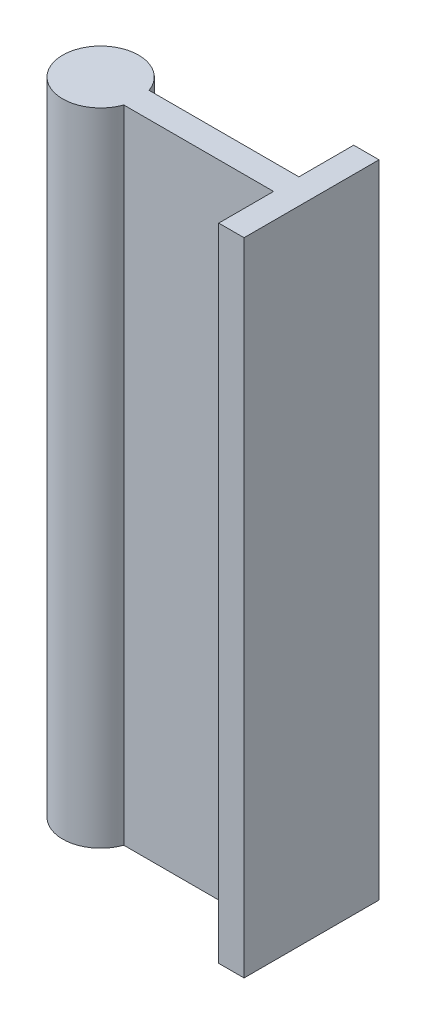
ISO-10303-21;
HEADER;
FILE_DESCRIPTION(('STEP AP214'),'2;1');
FILE_NAME('part.step','',(''),(''),'','','');
FILE_SCHEMA(('AUTOMOTIVE_DESIGN { 1 0 10303 214 1 1 1 1 }'));
ENDSEC;
DATA;
#1=APPLICATION_CONTEXT('core data for automotive mechanical design processes');
#2=APPLICATION_PROTOCOL_DEFINITION('international standard','automotive_design',2000,#1);
#3=PRODUCT_CONTEXT('',#1,'mechanical');
#4=PRODUCT('Part','Part','',(#3));
#5=PRODUCT_RELATED_PRODUCT_CATEGORY('part','',(#4));
#6=PRODUCT_DEFINITION_FORMATION('','',#4);
#7=PRODUCT_DEFINITION_CONTEXT('part definition',#1,'design');
#8=PRODUCT_DEFINITION('design','',#6,#7);
#9=PRODUCT_DEFINITION_SHAPE('','',#8);
#10=(LENGTH_UNIT() NAMED_UNIT(*) SI_UNIT(.MILLI.,.METRE.));
#11=(NAMED_UNIT(*) PLANE_ANGLE_UNIT() SI_UNIT($,.RADIAN.));
#12=(NAMED_UNIT(*) SI_UNIT($,.STERADIAN.) SOLID_ANGLE_UNIT());
#13=UNCERTAINTY_MEASURE_WITH_UNIT(LENGTH_MEASURE(1.E-05),#10,'distance_accuracy_value','');
#14=(GEOMETRIC_REPRESENTATION_CONTEXT(3) GLOBAL_UNCERTAINTY_ASSIGNED_CONTEXT((#13)) GLOBAL_UNIT_ASSIGNED_CONTEXT((#10,
#11,#12)) REPRESENTATION_CONTEXT('',''));
#15=CARTESIAN_POINT('',(0.,0.,0.));
#16=DIRECTION('',(0.,0.,1.));
#17=DIRECTION('',(1.,0.,0.));
#18=AXIS2_PLACEMENT_3D('',#15,#16,#17);
#19=CARTESIAN_POINT('',(0.,38.,0.));
#20=DIRECTION('',(0.,-1.,0.));
#21=DIRECTION('',(0.,0.,-1.));
#22=AXIS2_PLACEMENT_3D('',#19,#20,#21);
#23=CYLINDRICAL_SURFACE('',#22,2.25);
#24=CARTESIAN_POINT('',(0.,38.,0.));
#25=DIRECTION('',(0.,1.,0.));
#26=DIRECTION('',(0.,0.,1.));
#27=AXIS2_PLACEMENT_3D('',#24,#25,#26);
#28=CIRCLE('',#27,2.25);
#29=CARTESIAN_POINT('',(2.12132034355964,38.,-0.749999999999998));
#30=VERTEX_POINT('',#29);
#31=CARTESIAN_POINT('',(2.12132034355964,38.,0.750000000000002));
#32=VERTEX_POINT('',#31);
#33=EDGE_CURVE('E11',#30,#32,#28,.T.);
#34=ORIENTED_EDGE('',*,*,#33,.F.);
#35=DIRECTION('',(0.,-1.,0.));
#36=VECTOR('',#35,1.);
#37=CARTESIAN_POINT('',(2.12132034355964,38.,-0.749999999999998));
#38=LINE('',#37,#36);
#39=CARTESIAN_POINT('',(2.12132034355964,0.,-0.750000000000003));
#40=VERTEX_POINT('',#39);
#41=EDGE_CURVE('E141',#30,#40,#38,.T.);
#42=ORIENTED_EDGE('',*,*,#41,.T.);
#43=CARTESIAN_POINT('',(0.,0.,0.));
#44=DIRECTION('',(0.,1.,0.));
#45=DIRECTION('',(0.,0.,1.));
#46=AXIS2_PLACEMENT_3D('',#43,#44,#45);
#47=CIRCLE('',#46,2.25);
#48=CARTESIAN_POINT('',(2.12132034355964,0.,0.749999999999997));
#49=VERTEX_POINT('',#48);
#50=EDGE_CURVE('E36',#40,#49,#47,.T.);
#51=ORIENTED_EDGE('',*,*,#50,.T.);
#52=DIRECTION('',(0.,-1.,0.));
#53=VECTOR('',#52,1.);
#54=CARTESIAN_POINT('',(2.12132034355964,38.,0.750000000000002));
#55=LINE('',#54,#53);
#56=EDGE_CURVE('E133',#49,#32,#55,.F.);
#57=ORIENTED_EDGE('',*,*,#56,.T.);
#58=EDGE_LOOP('',(#34,#42,#51,#57));
#59=FACE_BOUND('',#58,.T.);
#60=ADVANCED_FACE('F33',(#59),#23,.T.);
#61=CARTESIAN_POINT('',(0.,38.,0.));
#62=DIRECTION('',(0.,1.,0.));
#63=DIRECTION('',(0.,0.,1.));
#64=AXIS2_PLACEMENT_3D('',#61,#62,#63);
#65=PLANE('',#64);
#66=ORIENTED_EDGE('',*,*,#33,.T.);
#67=DIRECTION('',(1.,0.,0.));
#68=VECTOR('',#67,1.);
#69=CARTESIAN_POINT('',(0.,38.,0.750000000000002));
#70=LINE('',#69,#68);
#71=CARTESIAN_POINT('',(11.,38.,0.750000000000002));
#72=VERTEX_POINT('',#71);
#73=EDGE_CURVE('E136',#32,#72,#70,.T.);
#74=ORIENTED_EDGE('',*,*,#73,.T.);
#75=DIRECTION('',(0.,0.,1.));
#76=VECTOR('',#75,1.);
#77=CARTESIAN_POINT('',(11.,38.,4.));
#78=LINE('',#77,#76);
#79=CARTESIAN_POINT('',(11.,38.,4.));
#80=VERTEX_POINT('',#79);
#81=EDGE_CURVE('E159',#72,#80,#78,.T.);
#82=ORIENTED_EDGE('',*,*,#81,.T.);
#83=DIRECTION('',(-1.,0.,0.));
#84=VECTOR('',#83,1.);
#85=CARTESIAN_POINT('',(12.5,38.,4.));
#86=LINE('',#85,#84);
#87=CARTESIAN_POINT('',(12.5,38.,4.));
#88=VERTEX_POINT('',#87);
#89=EDGE_CURVE('E103',#88,#80,#86,.T.);
#90=ORIENTED_EDGE('',*,*,#89,.F.);
#91=DIRECTION('',(0.,0.,1.));
#92=VECTOR('',#91,1.);
#93=CARTESIAN_POINT('',(12.5,38.,4.));
#94=LINE('',#93,#92);
#95=CARTESIAN_POINT('',(12.5,38.,-4.));
#96=VERTEX_POINT('',#95);
#97=EDGE_CURVE('E96',#96,#88,#94,.T.);
#98=ORIENTED_EDGE('',*,*,#97,.F.);
#99=DIRECTION('',(-1.,0.,0.));
#100=VECTOR('',#99,1.);
#101=CARTESIAN_POINT('',(12.5,38.,-4.));
#102=LINE('',#101,#100);
#103=CARTESIAN_POINT('',(11.,38.,-4.));
#104=VERTEX_POINT('',#103);
#105=EDGE_CURVE('E100',#96,#104,#102,.T.);
#106=ORIENTED_EDGE('',*,*,#105,.T.);
#107=CARTESIAN_POINT('',(11.,38.,-0.749999999999998));
#108=VERTEX_POINT('',#107);
#109=EDGE_CURVE('E161',#104,#108,#78,.T.);
#110=ORIENTED_EDGE('',*,*,#109,.T.);
#111=DIRECTION('',(1.,0.,0.));
#112=VECTOR('',#111,1.);
#113=CARTESIAN_POINT('',(0.,38.,-0.749999999999998));
#114=LINE('',#113,#112);
#115=EDGE_CURVE('E46',#30,#108,#114,.T.);
#116=ORIENTED_EDGE('',*,*,#115,.F.);
#117=EDGE_LOOP('',(#66,#74,#82,#90,#98,#106,#110,#116));
#118=FACE_BOUND('',#117,.T.);
#119=ADVANCED_FACE('F98',(#118),#65,.T.);
#120=CARTESIAN_POINT('',(0.,0.,0.));
#121=DIRECTION('',(0.,1.,0.));
#122=DIRECTION('',(0.,0.,1.));
#123=AXIS2_PLACEMENT_3D('',#120,#121,#122);
#124=PLANE('',#123);
#125=ORIENTED_EDGE('',*,*,#50,.F.);
#126=DIRECTION('',(1.,0.,0.));
#127=VECTOR('',#126,1.);
#128=CARTESIAN_POINT('',(0.,0.,-0.750000000000003));
#129=LINE('',#128,#127);
#130=CARTESIAN_POINT('',(11.,0.,-0.750000000000003));
#131=VERTEX_POINT('',#130);
#132=EDGE_CURVE('E53',#40,#131,#129,.T.);
#133=ORIENTED_EDGE('',*,*,#132,.T.);
#134=DIRECTION('',(0.,0.,-1.));
#135=VECTOR('',#134,1.);
#136=CARTESIAN_POINT('',(11.,0.,4.));
#137=LINE('',#136,#135);
#138=CARTESIAN_POINT('',(11.,0.,-4.));
#139=VERTEX_POINT('',#138);
#140=EDGE_CURVE('E167',#131,#139,#137,.T.);
#141=ORIENTED_EDGE('',*,*,#140,.T.);
#142=DIRECTION('',(-1.,0.,0.));
#143=VECTOR('',#142,1.);
#144=CARTESIAN_POINT('',(12.5,0.,-4.));
#145=LINE('',#144,#143);
#146=CARTESIAN_POINT('',(12.5,0.,-4.));
#147=VERTEX_POINT('',#146);
#148=EDGE_CURVE('E169',#147,#139,#145,.T.);
#149=ORIENTED_EDGE('',*,*,#148,.F.);
#150=DIRECTION('',(0.,0.,-1.));
#151=VECTOR('',#150,1.);
#152=CARTESIAN_POINT('',(12.5,0.,4.));
#153=LINE('',#152,#151);
#154=CARTESIAN_POINT('',(12.5,0.,4.));
#155=VERTEX_POINT('',#154);
#156=EDGE_CURVE('E112',#155,#147,#153,.T.);
#157=ORIENTED_EDGE('',*,*,#156,.F.);
#158=DIRECTION('',(-1.,0.,0.));
#159=VECTOR('',#158,1.);
#160=CARTESIAN_POINT('',(12.5,0.,4.));
#161=LINE('',#160,#159);
#162=CARTESIAN_POINT('',(11.,0.,4.));
#163=VERTEX_POINT('',#162);
#164=EDGE_CURVE('E126',#155,#163,#161,.T.);
#165=ORIENTED_EDGE('',*,*,#164,.T.);
#166=CARTESIAN_POINT('',(11.,0.,0.75));
#167=VERTEX_POINT('',#166);
#168=EDGE_CURVE('E116',#163,#167,#137,.T.);
#169=ORIENTED_EDGE('',*,*,#168,.T.);
#170=DIRECTION('',(1.,0.,0.));
#171=VECTOR('',#170,1.);
#172=CARTESIAN_POINT('',(0.,0.,0.749999999999997));
#173=LINE('',#172,#171);
#174=EDGE_CURVE('E134',#49,#167,#173,.T.);
#175=ORIENTED_EDGE('',*,*,#174,.F.);
#176=EDGE_LOOP('',(#125,#133,#141,#149,#157,#165,#169,#175));
#177=FACE_BOUND('',#176,.T.);
#178=ADVANCED_FACE('F148',(#177),#124,.F.);
#179=CARTESIAN_POINT('',(0.,38.,-0.749999999999998));
#180=DIRECTION('',(0.,0.,-1.));
#181=DIRECTION('',(0.,1.,0.));
#182=AXIS2_PLACEMENT_3D('',#179,#180,#181);
#183=PLANE('',#182);
#184=ORIENTED_EDGE('',*,*,#41,.F.);
#185=ORIENTED_EDGE('',*,*,#115,.T.);
#186=DIRECTION('',(0.,1.,0.));
#187=VECTOR('',#186,1.);
#188=CARTESIAN_POINT('',(11.,38.,-0.749999999999998));
#189=LINE('',#188,#187);
#190=EDGE_CURVE('E121',#131,#108,#189,.T.);
#191=ORIENTED_EDGE('',*,*,#190,.F.);
#192=ORIENTED_EDGE('',*,*,#132,.F.);
#193=EDGE_LOOP('',(#184,#185,#191,#192));
#194=FACE_BOUND('',#193,.T.);
#195=ADVANCED_FACE('F191',(#194),#183,.T.);
#196=CARTESIAN_POINT('',(0.,38.,0.750000000000002));
#197=DIRECTION('',(0.,0.,1.));
#198=DIRECTION('',(0.,-1.,0.));
#199=AXIS2_PLACEMENT_3D('',#196,#197,#198);
#200=PLANE('',#199);
#201=ORIENTED_EDGE('',*,*,#56,.F.);
#202=ORIENTED_EDGE('',*,*,#174,.T.);
#203=DIRECTION('',(0.,-1.,0.));
#204=VECTOR('',#203,1.);
#205=CARTESIAN_POINT('',(11.,38.,0.750000000000002));
#206=LINE('',#205,#204);
#207=EDGE_CURVE('E124',#72,#167,#206,.T.);
#208=ORIENTED_EDGE('',*,*,#207,.F.);
#209=ORIENTED_EDGE('',*,*,#73,.F.);
#210=EDGE_LOOP('',(#201,#202,#208,#209));
#211=FACE_BOUND('',#210,.T.);
#212=ADVANCED_FACE('F154',(#211),#200,.T.);
#213=CARTESIAN_POINT('',(11.,0.,0.));
#214=DIRECTION('',(1.,0.,0.));
#215=DIRECTION('',(0.,0.,-1.));
#216=AXIS2_PLACEMENT_3D('',#213,#214,#215);
#217=PLANE('',#216);
#218=ORIENTED_EDGE('',*,*,#140,.F.);
#219=ORIENTED_EDGE('',*,*,#190,.T.);
#220=ORIENTED_EDGE('',*,*,#109,.F.);
#221=DIRECTION('',(0.,1.,0.));
#222=VECTOR('',#221,1.);
#223=CARTESIAN_POINT('',(11.,38.,-4.));
#224=LINE('',#223,#222);
#225=EDGE_CURVE('E120',#139,#104,#224,.T.);
#226=ORIENTED_EDGE('',*,*,#225,.F.);
#227=EDGE_LOOP('',(#218,#219,#220,#226));
#228=FACE_BOUND('',#227,.T.);
#229=ADVANCED_FACE('F196',(#228),#217,.F.);
#230=ORIENTED_EDGE('',*,*,#81,.F.);
#231=ORIENTED_EDGE('',*,*,#207,.T.);
#232=ORIENTED_EDGE('',*,*,#168,.F.);
#233=DIRECTION('',(0.,-1.,0.));
#234=VECTOR('',#233,1.);
#235=CARTESIAN_POINT('',(11.,38.,4.));
#236=LINE('',#235,#234);
#237=EDGE_CURVE('E160',#80,#163,#236,.T.);
#238=ORIENTED_EDGE('',*,*,#237,.F.);
#239=EDGE_LOOP('',(#230,#231,#232,#238));
#240=FACE_BOUND('',#239,.T.);
#241=ADVANCED_FACE('F157',(#240),#217,.F.);
#242=CARTESIAN_POINT('',(12.5,38.,-4.));
#243=DIRECTION('',(0.,0.,1.));
#244=DIRECTION('',(0.,-1.,0.));
#245=AXIS2_PLACEMENT_3D('',#242,#243,#244);
#246=PLANE('',#245);
#247=ORIENTED_EDGE('',*,*,#225,.T.);
#248=ORIENTED_EDGE('',*,*,#105,.F.);
#249=DIRECTION('',(0.,1.,0.));
#250=VECTOR('',#249,1.);
#251=CARTESIAN_POINT('',(12.5,38.,-4.));
#252=LINE('',#251,#250);
#253=EDGE_CURVE('E107',#147,#96,#252,.T.);
#254=ORIENTED_EDGE('',*,*,#253,.F.);
#255=ORIENTED_EDGE('',*,*,#148,.T.);
#256=EDGE_LOOP('',(#247,#248,#254,#255));
#257=FACE_BOUND('',#256,.T.);
#258=ADVANCED_FACE('F118',(#257),#246,.F.);
#259=CARTESIAN_POINT('',(12.5,38.,4.));
#260=DIRECTION('',(0.,0.,-1.));
#261=DIRECTION('',(0.,1.,0.));
#262=AXIS2_PLACEMENT_3D('',#259,#260,#261);
#263=PLANE('',#262);
#264=ORIENTED_EDGE('',*,*,#237,.T.);
#265=ORIENTED_EDGE('',*,*,#164,.F.);
#266=DIRECTION('',(0.,-1.,0.));
#267=VECTOR('',#266,1.);
#268=CARTESIAN_POINT('',(12.5,38.,4.));
#269=LINE('',#268,#267);
#270=EDGE_CURVE('E106',#88,#155,#269,.T.);
#271=ORIENTED_EDGE('',*,*,#270,.F.);
#272=ORIENTED_EDGE('',*,*,#89,.T.);
#273=EDGE_LOOP('',(#264,#265,#271,#272));
#274=FACE_BOUND('',#273,.T.);
#275=ADVANCED_FACE('F172',(#274),#263,.F.);
#276=CARTESIAN_POINT('',(12.5,0.,0.));
#277=DIRECTION('',(1.,0.,0.));
#278=DIRECTION('',(0.,0.,-1.));
#279=AXIS2_PLACEMENT_3D('',#276,#277,#278);
#280=PLANE('',#279);
#281=ORIENTED_EDGE('',*,*,#253,.T.);
#282=ORIENTED_EDGE('',*,*,#97,.T.);
#283=ORIENTED_EDGE('',*,*,#270,.T.);
#284=ORIENTED_EDGE('',*,*,#156,.T.);
#285=EDGE_LOOP('',(#281,#282,#283,#284));
#286=FACE_BOUND('',#285,.T.);
#287=ADVANCED_FACE('F110',(#286),#280,.T.);
#288=CLOSED_SHELL('',(#60,#119,#178,#195,#212,#229,#241,#258,#275,#287));
#289=MANIFOLD_SOLID_BREP('B2',#288);
#290=ADVANCED_BREP_SHAPE_REPRESENTATION('',(#18,#289),#14);
#291=SHAPE_DEFINITION_REPRESENTATION(#9,#290);
ENDSEC;
END-ISO-10303-21;
